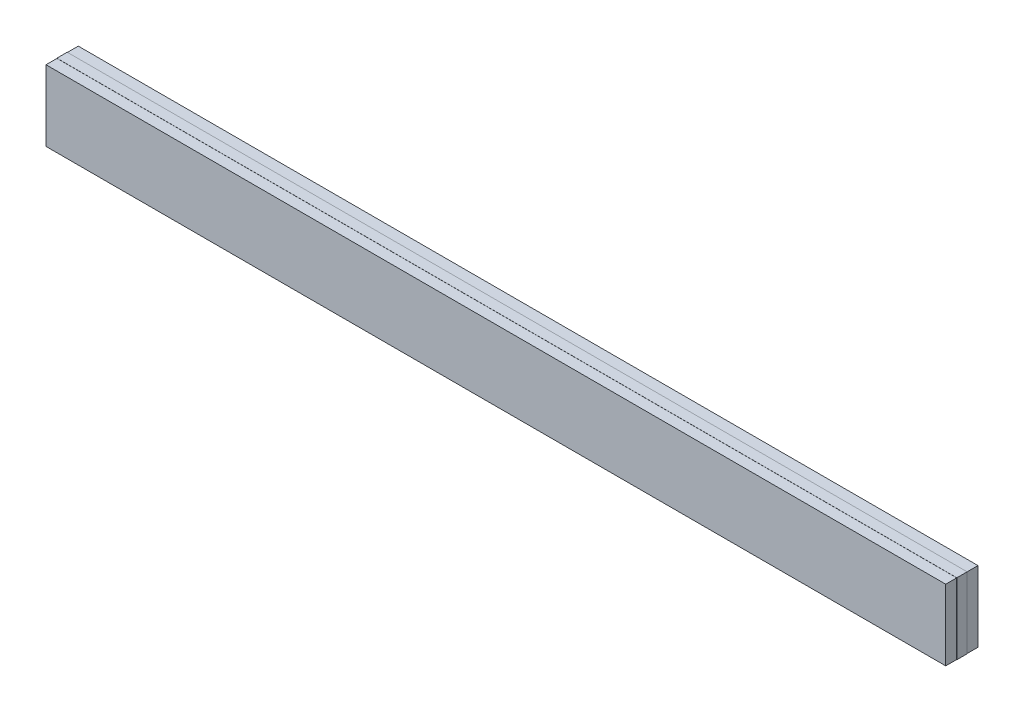
ISO-10303-21;
HEADER;
FILE_DESCRIPTION(('STEP AP214'),'2;1');
FILE_NAME('part.step','',(''),(''),'','','');
FILE_SCHEMA(('AUTOMOTIVE_DESIGN { 1 0 10303 214 1 1 1 1 }'));
ENDSEC;
DATA;
#1=APPLICATION_CONTEXT('core data for automotive mechanical design processes');
#2=APPLICATION_PROTOCOL_DEFINITION('international standard','automotive_design',2000,#1);
#3=PRODUCT_CONTEXT('',#1,'mechanical');
#4=PRODUCT('Part','Part','',(#3));
#5=PRODUCT_RELATED_PRODUCT_CATEGORY('part','',(#4));
#6=PRODUCT_DEFINITION_FORMATION('','',#4);
#7=PRODUCT_DEFINITION_CONTEXT('part definition',#1,'design');
#8=PRODUCT_DEFINITION('design','',#6,#7);
#9=PRODUCT_DEFINITION_SHAPE('','',#8);
#10=(LENGTH_UNIT() NAMED_UNIT(*) SI_UNIT(.MILLI.,.METRE.));
#11=(NAMED_UNIT(*) PLANE_ANGLE_UNIT() SI_UNIT($,.RADIAN.));
#12=(NAMED_UNIT(*) SI_UNIT($,.STERADIAN.) SOLID_ANGLE_UNIT());
#13=UNCERTAINTY_MEASURE_WITH_UNIT(LENGTH_MEASURE(1.E-05),#10,'distance_accuracy_value','');
#14=(GEOMETRIC_REPRESENTATION_CONTEXT(3) GLOBAL_UNCERTAINTY_ASSIGNED_CONTEXT((#13)) GLOBAL_UNIT_ASSIGNED_CONTEXT((#10,
#11,#12)) REPRESENTATION_CONTEXT('',''));
#15=CARTESIAN_POINT('',(0.,0.,0.));
#16=DIRECTION('',(0.,0.,1.));
#17=DIRECTION('',(1.,0.,0.));
#18=AXIS2_PLACEMENT_3D('',#15,#16,#17);
#19=CARTESIAN_POINT('',(0.,0.,-0.4));
#20=DIRECTION('',(0.,0.,1.));
#21=DIRECTION('',(1.,0.,0.));
#22=AXIS2_PLACEMENT_3D('',#19,#20,#21);
#23=PLANE('',#22);
#24=DIRECTION('',(0.,1.,0.));
#25=VECTOR('',#24,1.);
#26=CARTESIAN_POINT('',(34.85,2.75,-0.4));
#27=LINE('',#26,#25);
#28=CARTESIAN_POINT('',(34.85,-2.75,-0.4));
#29=VERTEX_POINT('',#28);
#30=CARTESIAN_POINT('',(34.85,2.75,-0.4));
#31=VERTEX_POINT('',#30);
#32=EDGE_CURVE('E179',#29,#31,#27,.T.);
#33=ORIENTED_EDGE('',*,*,#32,.F.);
#34=DIRECTION('',(1.,0.,0.));
#35=VECTOR('',#34,1.);
#36=CARTESIAN_POINT('',(-34.85,-2.75,-0.4));
#37=LINE('',#36,#35);
#38=CARTESIAN_POINT('',(-34.85,-2.75,-0.4));
#39=VERTEX_POINT('',#38);
#40=EDGE_CURVE('E184',#39,#29,#37,.T.);
#41=ORIENTED_EDGE('',*,*,#40,.F.);
#42=DIRECTION('',(0.,-1.,0.));
#43=VECTOR('',#42,1.);
#44=CARTESIAN_POINT('',(-34.85,2.75,-0.4));
#45=LINE('',#44,#43);
#46=CARTESIAN_POINT('',(-34.85,2.75,-0.4));
#47=VERTEX_POINT('',#46);
#48=EDGE_CURVE('E195',#47,#39,#45,.T.);
#49=ORIENTED_EDGE('',*,*,#48,.F.);
#50=DIRECTION('',(-1.,0.,0.));
#51=VECTOR('',#50,1.);
#52=CARTESIAN_POINT('',(-34.85,2.75,-0.4));
#53=LINE('',#52,#51);
#54=EDGE_CURVE('E193',#31,#47,#53,.T.);
#55=ORIENTED_EDGE('',*,*,#54,.F.);
#56=EDGE_LOOP('',(#33,#41,#49,#55));
#57=FACE_BOUND('',#56,.T.);
#58=DIRECTION('',(1.,0.,0.));
#59=VECTOR('',#58,1.);
#60=CARTESIAN_POINT('',(-34.84,2.74,-0.4));
#61=LINE('',#60,#59);
#62=CARTESIAN_POINT('',(-34.84,2.74,-0.4));
#63=VERTEX_POINT('',#62);
#64=CARTESIAN_POINT('',(34.84,2.74,-0.4));
#65=VERTEX_POINT('',#64);
#66=EDGE_CURVE('E144',#63,#65,#61,.T.);
#67=ORIENTED_EDGE('',*,*,#66,.F.);
#68=DIRECTION('',(0.,1.,0.));
#69=VECTOR('',#68,1.);
#70=CARTESIAN_POINT('',(-34.84,-2.74,-0.4));
#71=LINE('',#70,#69);
#72=CARTESIAN_POINT('',(-34.84,-2.74,-0.4));
#73=VERTEX_POINT('',#72);
#74=EDGE_CURVE('E141',#73,#63,#71,.T.);
#75=ORIENTED_EDGE('',*,*,#74,.F.);
#76=DIRECTION('',(-1.,0.,0.));
#77=VECTOR('',#76,1.);
#78=CARTESIAN_POINT('',(34.84,-2.74,-0.4));
#79=LINE('',#78,#77);
#80=CARTESIAN_POINT('',(34.84,-2.74,-0.4));
#81=VERTEX_POINT('',#80);
#82=EDGE_CURVE('E55',#81,#73,#79,.T.);
#83=ORIENTED_EDGE('',*,*,#82,.F.);
#84=DIRECTION('',(0.,-1.,0.));
#85=VECTOR('',#84,1.);
#86=CARTESIAN_POINT('',(34.84,2.74,-0.4));
#87=LINE('',#86,#85);
#88=EDGE_CURVE('E50',#65,#81,#87,.T.);
#89=ORIENTED_EDGE('',*,*,#88,.F.);
#90=EDGE_LOOP('',(#67,#75,#83,#89));
#91=FACE_BOUND('',#90,.T.);
#92=ADVANCED_FACE('F35',(#57,#91),#23,.F.);
#93=CARTESIAN_POINT('',(0.,0.,0.4));
#94=DIRECTION('',(0.,0.,1.));
#95=DIRECTION('',(1.,0.,0.));
#96=AXIS2_PLACEMENT_3D('',#93,#94,#95);
#97=PLANE('',#96);
#98=DIRECTION('',(0.,1.,0.));
#99=VECTOR('',#98,1.);
#100=CARTESIAN_POINT('',(34.85,2.75,0.4));
#101=LINE('',#100,#99);
#102=CARTESIAN_POINT('',(34.85,-2.75,0.4));
#103=VERTEX_POINT('',#102);
#104=CARTESIAN_POINT('',(34.85,2.75,0.4));
#105=VERTEX_POINT('',#104);
#106=EDGE_CURVE('E180',#103,#105,#101,.T.);
#107=ORIENTED_EDGE('',*,*,#106,.T.);
#108=DIRECTION('',(-1.,0.,0.));
#109=VECTOR('',#108,1.);
#110=CARTESIAN_POINT('',(-34.85,2.75,0.4));
#111=LINE('',#110,#109);
#112=CARTESIAN_POINT('',(-34.85,2.75,0.4));
#113=VERTEX_POINT('',#112);
#114=EDGE_CURVE('E183',#105,#113,#111,.T.);
#115=ORIENTED_EDGE('',*,*,#114,.T.);
#116=DIRECTION('',(0.,-1.,0.));
#117=VECTOR('',#116,1.);
#118=CARTESIAN_POINT('',(-34.85,2.75,0.4));
#119=LINE('',#118,#117);
#120=CARTESIAN_POINT('',(-34.85,-2.75,0.4));
#121=VERTEX_POINT('',#120);
#122=EDGE_CURVE('E186',#113,#121,#119,.T.);
#123=ORIENTED_EDGE('',*,*,#122,.T.);
#124=DIRECTION('',(1.,0.,0.));
#125=VECTOR('',#124,1.);
#126=CARTESIAN_POINT('',(-34.85,-2.75,0.4));
#127=LINE('',#126,#125);
#128=EDGE_CURVE('E188',#121,#103,#127,.T.);
#129=ORIENTED_EDGE('',*,*,#128,.T.);
#130=EDGE_LOOP('',(#107,#115,#123,#129));
#131=FACE_BOUND('',#130,.T.);
#132=DIRECTION('',(0.,1.,0.));
#133=VECTOR('',#132,1.);
#134=CARTESIAN_POINT('',(34.84,-2.74,0.4));
#135=LINE('',#134,#133);
#136=CARTESIAN_POINT('',(34.84,-2.74,0.4));
#137=VERTEX_POINT('',#136);
#138=CARTESIAN_POINT('',(34.84,2.74,0.4));
#139=VERTEX_POINT('',#138);
#140=EDGE_CURVE('E148',#137,#139,#135,.T.);
#141=ORIENTED_EDGE('',*,*,#140,.F.);
#142=DIRECTION('',(1.,0.,0.));
#143=VECTOR('',#142,1.);
#144=CARTESIAN_POINT('',(-34.84,-2.74,0.4));
#145=LINE('',#144,#143);
#146=CARTESIAN_POINT('',(-34.84,-2.74,0.4));
#147=VERTEX_POINT('',#146);
#148=EDGE_CURVE('E145',#147,#137,#145,.T.);
#149=ORIENTED_EDGE('',*,*,#148,.F.);
#150=DIRECTION('',(0.,-1.,0.));
#151=VECTOR('',#150,1.);
#152=CARTESIAN_POINT('',(-34.84,2.74,0.4));
#153=LINE('',#152,#151);
#154=CARTESIAN_POINT('',(-34.84,2.74,0.4));
#155=VERTEX_POINT('',#154);
#156=EDGE_CURVE('E158',#155,#147,#153,.T.);
#157=ORIENTED_EDGE('',*,*,#156,.F.);
#158=DIRECTION('',(-1.,0.,0.));
#159=VECTOR('',#158,1.);
#160=CARTESIAN_POINT('',(34.84,2.74,0.4));
#161=LINE('',#160,#159);
#162=EDGE_CURVE('E166',#139,#155,#161,.T.);
#163=ORIENTED_EDGE('',*,*,#162,.F.);
#164=EDGE_LOOP('',(#141,#149,#157,#163));
#165=FACE_BOUND('',#164,.T.);
#166=ADVANCED_FACE('F221',(#131,#165),#97,.T.);
#167=CARTESIAN_POINT('',(34.85,2.75,0.4));
#168=DIRECTION('',(-1.,0.,0.));
#169=DIRECTION('',(0.,0.,1.));
#170=AXIS2_PLACEMENT_3D('',#167,#168,#169);
#171=PLANE('',#170);
#172=ORIENTED_EDGE('',*,*,#32,.T.);
#173=DIRECTION('',(0.,0.,-1.));
#174=VECTOR('',#173,1.);
#175=CARTESIAN_POINT('',(34.85,2.75,0.4));
#176=LINE('',#175,#174);
#177=EDGE_CURVE('E11',#105,#31,#176,.T.);
#178=ORIENTED_EDGE('',*,*,#177,.F.);
#179=ORIENTED_EDGE('',*,*,#106,.F.);
#180=DIRECTION('',(0.,0.,-1.));
#181=VECTOR('',#180,1.);
#182=CARTESIAN_POINT('',(34.85,-2.75,0.4));
#183=LINE('',#182,#181);
#184=EDGE_CURVE('E190',#103,#29,#183,.T.);
#185=ORIENTED_EDGE('',*,*,#184,.T.);
#186=EDGE_LOOP('',(#172,#178,#179,#185));
#187=FACE_BOUND('',#186,.T.);
#188=ADVANCED_FACE('F37',(#187),#171,.F.);
#189=CARTESIAN_POINT('',(-34.85,2.75,0.4));
#190=DIRECTION('',(0.,-1.,0.));
#191=DIRECTION('',(0.,0.,-1.));
#192=AXIS2_PLACEMENT_3D('',#189,#190,#191);
#193=PLANE('',#192);
#194=ORIENTED_EDGE('',*,*,#54,.T.);
#195=DIRECTION('',(0.,0.,-1.));
#196=VECTOR('',#195,1.);
#197=CARTESIAN_POINT('',(-34.85,2.75,0.4));
#198=LINE('',#197,#196);
#199=EDGE_CURVE('E43',#113,#47,#198,.T.);
#200=ORIENTED_EDGE('',*,*,#199,.F.);
#201=ORIENTED_EDGE('',*,*,#114,.F.);
#202=ORIENTED_EDGE('',*,*,#177,.T.);
#203=EDGE_LOOP('',(#194,#200,#201,#202));
#204=FACE_BOUND('',#203,.T.);
#205=ADVANCED_FACE('F223',(#204),#193,.F.);
#206=CARTESIAN_POINT('',(-34.85,2.75,0.4));
#207=DIRECTION('',(1.,0.,0.));
#208=DIRECTION('',(0.,0.,-1.));
#209=AXIS2_PLACEMENT_3D('',#206,#207,#208);
#210=PLANE('',#209);
#211=ORIENTED_EDGE('',*,*,#48,.T.);
#212=DIRECTION('',(0.,0.,-1.));
#213=VECTOR('',#212,1.);
#214=CARTESIAN_POINT('',(-34.85,-2.75,0.4));
#215=LINE('',#214,#213);
#216=EDGE_CURVE('E200',#121,#39,#215,.T.);
#217=ORIENTED_EDGE('',*,*,#216,.F.);
#218=ORIENTED_EDGE('',*,*,#122,.F.);
#219=ORIENTED_EDGE('',*,*,#199,.T.);
#220=EDGE_LOOP('',(#211,#217,#218,#219));
#221=FACE_BOUND('',#220,.T.);
#222=ADVANCED_FACE('F207',(#221),#210,.F.);
#223=CARTESIAN_POINT('',(-34.85,-2.75,0.4));
#224=DIRECTION('',(0.,1.,0.));
#225=DIRECTION('',(0.,0.,1.));
#226=AXIS2_PLACEMENT_3D('',#223,#224,#225);
#227=PLANE('',#226);
#228=ORIENTED_EDGE('',*,*,#40,.T.);
#229=ORIENTED_EDGE('',*,*,#184,.F.);
#230=ORIENTED_EDGE('',*,*,#128,.F.);
#231=ORIENTED_EDGE('',*,*,#216,.T.);
#232=EDGE_LOOP('',(#228,#229,#230,#231));
#233=FACE_BOUND('',#232,.T.);
#234=ADVANCED_FACE('F215',(#233),#227,.F.);
#235=CARTESIAN_POINT('',(-34.84,-2.74,1.25));
#236=DIRECTION('',(0.,1.,0.));
#237=DIRECTION('',(0.,0.,1.));
#238=AXIS2_PLACEMENT_3D('',#235,#236,#237);
#239=PLANE('',#238);
#240=ORIENTED_EDGE('',*,*,#148,.T.);
#241=DIRECTION('',(0.,0.,-1.));
#242=VECTOR('',#241,1.);
#243=CARTESIAN_POINT('',(34.84,-2.74,1.25));
#244=LINE('',#243,#242);
#245=CARTESIAN_POINT('',(34.84,-2.74,1.25));
#246=VERTEX_POINT('',#245);
#247=EDGE_CURVE('E177',#246,#137,#244,.T.);
#248=ORIENTED_EDGE('',*,*,#247,.F.);
#249=DIRECTION('',(1.,0.,0.));
#250=VECTOR('',#249,1.);
#251=CARTESIAN_POINT('',(-34.84,-2.74,1.25));
#252=LINE('',#251,#250);
#253=CARTESIAN_POINT('',(-34.84,-2.74,1.25));
#254=VERTEX_POINT('',#253);
#255=EDGE_CURVE('E154',#254,#246,#252,.T.);
#256=ORIENTED_EDGE('',*,*,#255,.F.);
#257=DIRECTION('',(0.,0.,-1.));
#258=VECTOR('',#257,1.);
#259=CARTESIAN_POINT('',(-34.84,-2.74,1.25));
#260=LINE('',#259,#258);
#261=EDGE_CURVE('E163',#254,#147,#260,.T.);
#262=ORIENTED_EDGE('',*,*,#261,.T.);
#263=EDGE_LOOP('',(#240,#248,#256,#262));
#264=FACE_BOUND('',#263,.T.);
#265=ADVANCED_FACE('F239',(#264),#239,.F.);
#266=CARTESIAN_POINT('',(34.84,-2.74,1.25));
#267=DIRECTION('',(-1.,0.,0.));
#268=DIRECTION('',(0.,0.,1.));
#269=AXIS2_PLACEMENT_3D('',#266,#267,#268);
#270=PLANE('',#269);
#271=ORIENTED_EDGE('',*,*,#140,.T.);
#272=DIRECTION('',(0.,0.,-1.));
#273=VECTOR('',#272,1.);
#274=CARTESIAN_POINT('',(34.84,2.74,1.25));
#275=LINE('',#274,#273);
#276=CARTESIAN_POINT('',(34.84,2.74,1.25));
#277=VERTEX_POINT('',#276);
#278=EDGE_CURVE('E174',#277,#139,#275,.T.);
#279=ORIENTED_EDGE('',*,*,#278,.F.);
#280=DIRECTION('',(0.,1.,0.));
#281=VECTOR('',#280,1.);
#282=CARTESIAN_POINT('',(34.84,-2.74,1.25));
#283=LINE('',#282,#281);
#284=EDGE_CURVE('E157',#246,#277,#283,.T.);
#285=ORIENTED_EDGE('',*,*,#284,.F.);
#286=ORIENTED_EDGE('',*,*,#247,.T.);
#287=EDGE_LOOP('',(#271,#279,#285,#286));
#288=FACE_BOUND('',#287,.T.);
#289=ADVANCED_FACE('F243',(#288),#270,.F.);
#290=CARTESIAN_POINT('',(34.84,2.74,1.25));
#291=DIRECTION('',(0.,-1.,0.));
#292=DIRECTION('',(0.,0.,-1.));
#293=AXIS2_PLACEMENT_3D('',#290,#291,#292);
#294=PLANE('',#293);
#295=ORIENTED_EDGE('',*,*,#162,.T.);
#296=DIRECTION('',(0.,0.,-1.));
#297=VECTOR('',#296,1.);
#298=CARTESIAN_POINT('',(-34.84,2.74,1.25));
#299=LINE('',#298,#297);
#300=CARTESIAN_POINT('',(-34.84,2.74,1.25));
#301=VERTEX_POINT('',#300);
#302=EDGE_CURVE('E172',#301,#155,#299,.T.);
#303=ORIENTED_EDGE('',*,*,#302,.F.);
#304=DIRECTION('',(-1.,0.,0.));
#305=VECTOR('',#304,1.);
#306=CARTESIAN_POINT('',(34.84,2.74,1.25));
#307=LINE('',#306,#305);
#308=EDGE_CURVE('E160',#277,#301,#307,.T.);
#309=ORIENTED_EDGE('',*,*,#308,.F.);
#310=ORIENTED_EDGE('',*,*,#278,.T.);
#311=EDGE_LOOP('',(#295,#303,#309,#310));
#312=FACE_BOUND('',#311,.T.);
#313=ADVANCED_FACE('F248',(#312),#294,.F.);
#314=CARTESIAN_POINT('',(-34.84,2.74,1.25));
#315=DIRECTION('',(1.,0.,0.));
#316=DIRECTION('',(0.,0.,-1.));
#317=AXIS2_PLACEMENT_3D('',#314,#315,#316);
#318=PLANE('',#317);
#319=ORIENTED_EDGE('',*,*,#156,.T.);
#320=ORIENTED_EDGE('',*,*,#261,.F.);
#321=DIRECTION('',(0.,-1.,0.));
#322=VECTOR('',#321,1.);
#323=CARTESIAN_POINT('',(-34.84,2.74,1.25));
#324=LINE('',#323,#322);
#325=EDGE_CURVE('E162',#301,#254,#324,.T.);
#326=ORIENTED_EDGE('',*,*,#325,.F.);
#327=ORIENTED_EDGE('',*,*,#302,.T.);
#328=EDGE_LOOP('',(#319,#320,#326,#327));
#329=FACE_BOUND('',#328,.T.);
#330=ADVANCED_FACE('F254',(#329),#318,.F.);
#331=CARTESIAN_POINT('',(0.,0.,1.25));
#332=DIRECTION('',(0.,0.,1.));
#333=DIRECTION('',(1.,0.,0.));
#334=AXIS2_PLACEMENT_3D('',#331,#332,#333);
#335=PLANE('',#334);
#336=ORIENTED_EDGE('',*,*,#255,.T.);
#337=ORIENTED_EDGE('',*,*,#284,.T.);
#338=ORIENTED_EDGE('',*,*,#308,.T.);
#339=ORIENTED_EDGE('',*,*,#325,.T.);
#340=EDGE_LOOP('',(#336,#337,#338,#339));
#341=FACE_BOUND('',#340,.T.);
#342=ADVANCED_FACE('F258',(#341),#335,.T.);
#343=CARTESIAN_POINT('',(-34.84,2.74,-1.25));
#344=DIRECTION('',(0.,-1.,0.));
#345=DIRECTION('',(0.,0.,-1.));
#346=AXIS2_PLACEMENT_3D('',#343,#344,#345);
#347=PLANE('',#346);
#348=ORIENTED_EDGE('',*,*,#66,.T.);
#349=DIRECTION('',(0.,0.,1.));
#350=VECTOR('',#349,1.);
#351=CARTESIAN_POINT('',(34.84,2.74,-1.25));
#352=LINE('',#351,#350);
#353=CARTESIAN_POINT('',(34.84,2.74,-1.25));
#354=VERTEX_POINT('',#353);
#355=EDGE_CURVE('E125',#354,#65,#352,.T.);
#356=ORIENTED_EDGE('',*,*,#355,.F.);
#357=DIRECTION('',(1.,0.,0.));
#358=VECTOR('',#357,1.);
#359=CARTESIAN_POINT('',(-34.84,2.74,-1.25));
#360=LINE('',#359,#358);
#361=CARTESIAN_POINT('',(-34.84,2.74,-1.25));
#362=VERTEX_POINT('',#361);
#363=EDGE_CURVE('E132',#362,#354,#360,.T.);
#364=ORIENTED_EDGE('',*,*,#363,.F.);
#365=DIRECTION('',(0.,0.,1.));
#366=VECTOR('',#365,1.);
#367=CARTESIAN_POINT('',(-34.84,2.74,-1.25));
#368=LINE('',#367,#366);
#369=EDGE_CURVE('E366',#362,#63,#368,.T.);
#370=ORIENTED_EDGE('',*,*,#369,.T.);
#371=EDGE_LOOP('',(#348,#356,#364,#370));
#372=FACE_BOUND('',#371,.T.);
#373=ADVANCED_FACE('F143',(#372),#347,.F.);
#374=CARTESIAN_POINT('',(34.84,2.74,-1.25));
#375=DIRECTION('',(-1.,0.,0.));
#376=DIRECTION('',(0.,0.,1.));
#377=AXIS2_PLACEMENT_3D('',#374,#375,#376);
#378=PLANE('',#377);
#379=ORIENTED_EDGE('',*,*,#88,.T.);
#380=DIRECTION('',(0.,0.,1.));
#381=VECTOR('',#380,1.);
#382=CARTESIAN_POINT('',(34.84,-2.74,-1.25));
#383=LINE('',#382,#381);
#384=CARTESIAN_POINT('',(34.84,-2.74,-1.25));
#385=VERTEX_POINT('',#384);
#386=EDGE_CURVE('E128',#385,#81,#383,.T.);
#387=ORIENTED_EDGE('',*,*,#386,.F.);
#388=DIRECTION('',(0.,-1.,0.));
#389=VECTOR('',#388,1.);
#390=CARTESIAN_POINT('',(34.84,2.74,-1.25));
#391=LINE('',#390,#389);
#392=EDGE_CURVE('E121',#354,#385,#391,.T.);
#393=ORIENTED_EDGE('',*,*,#392,.F.);
#394=ORIENTED_EDGE('',*,*,#355,.T.);
#395=EDGE_LOOP('',(#379,#387,#393,#394));
#396=FACE_BOUND('',#395,.T.);
#397=ADVANCED_FACE('F123',(#396),#378,.F.);
#398=CARTESIAN_POINT('',(34.84,-2.74,-1.25));
#399=DIRECTION('',(0.,1.,0.));
#400=DIRECTION('',(0.,0.,1.));
#401=AXIS2_PLACEMENT_3D('',#398,#399,#400);
#402=PLANE('',#401);
#403=ORIENTED_EDGE('',*,*,#82,.T.);
#404=DIRECTION('',(0.,0.,1.));
#405=VECTOR('',#404,1.);
#406=CARTESIAN_POINT('',(-34.84,-2.74,-1.25));
#407=LINE('',#406,#405);
#408=CARTESIAN_POINT('',(-34.84,-2.74,-1.25));
#409=VERTEX_POINT('',#408);
#410=EDGE_CURVE('E150',#409,#73,#407,.T.);
#411=ORIENTED_EDGE('',*,*,#410,.F.);
#412=DIRECTION('',(-1.,0.,0.));
#413=VECTOR('',#412,1.);
#414=CARTESIAN_POINT('',(34.84,-2.74,-1.25));
#415=LINE('',#414,#413);
#416=EDGE_CURVE('E131',#385,#409,#415,.T.);
#417=ORIENTED_EDGE('',*,*,#416,.F.);
#418=ORIENTED_EDGE('',*,*,#386,.T.);
#419=EDGE_LOOP('',(#403,#411,#417,#418));
#420=FACE_BOUND('',#419,.T.);
#421=ADVANCED_FACE('F267',(#420),#402,.F.);
#422=CARTESIAN_POINT('',(-34.84,-2.74,-1.25));
#423=DIRECTION('',(1.,0.,0.));
#424=DIRECTION('',(0.,0.,-1.));
#425=AXIS2_PLACEMENT_3D('',#422,#423,#424);
#426=PLANE('',#425);
#427=ORIENTED_EDGE('',*,*,#74,.T.);
#428=ORIENTED_EDGE('',*,*,#369,.F.);
#429=DIRECTION('',(0.,1.,0.));
#430=VECTOR('',#429,1.);
#431=CARTESIAN_POINT('',(-34.84,-2.74,-1.25));
#432=LINE('',#431,#430);
#433=EDGE_CURVE('E137',#409,#362,#432,.T.);
#434=ORIENTED_EDGE('',*,*,#433,.F.);
#435=ORIENTED_EDGE('',*,*,#410,.T.);
#436=EDGE_LOOP('',(#427,#428,#434,#435));
#437=FACE_BOUND('',#436,.T.);
#438=ADVANCED_FACE('F270',(#437),#426,.F.);
#439=CARTESIAN_POINT('',(0.,0.,-1.25));
#440=DIRECTION('',(0.,0.,-1.));
#441=DIRECTION('',(-1.,0.,0.));
#442=AXIS2_PLACEMENT_3D('',#439,#440,#441);
#443=PLANE('',#442);
#444=ORIENTED_EDGE('',*,*,#363,.T.);
#445=ORIENTED_EDGE('',*,*,#392,.T.);
#446=ORIENTED_EDGE('',*,*,#416,.T.);
#447=ORIENTED_EDGE('',*,*,#433,.T.);
#448=EDGE_LOOP('',(#444,#445,#446,#447));
#449=FACE_BOUND('',#448,.T.);
#450=ADVANCED_FACE('F135',(#449),#443,.T.);
#451=CLOSED_SHELL('',(#92,#166,#188,#205,#222,#234,#265,#289,#313,#330,#342,#373,#397,#421,#438,#450));
#452=MANIFOLD_SOLID_BREP('B2',#451);
#453=ADVANCED_BREP_SHAPE_REPRESENTATION('',(#18,#452),#14);
#454=SHAPE_DEFINITION_REPRESENTATION(#9,#453);
ENDSEC;
END-ISO-10303-21;
